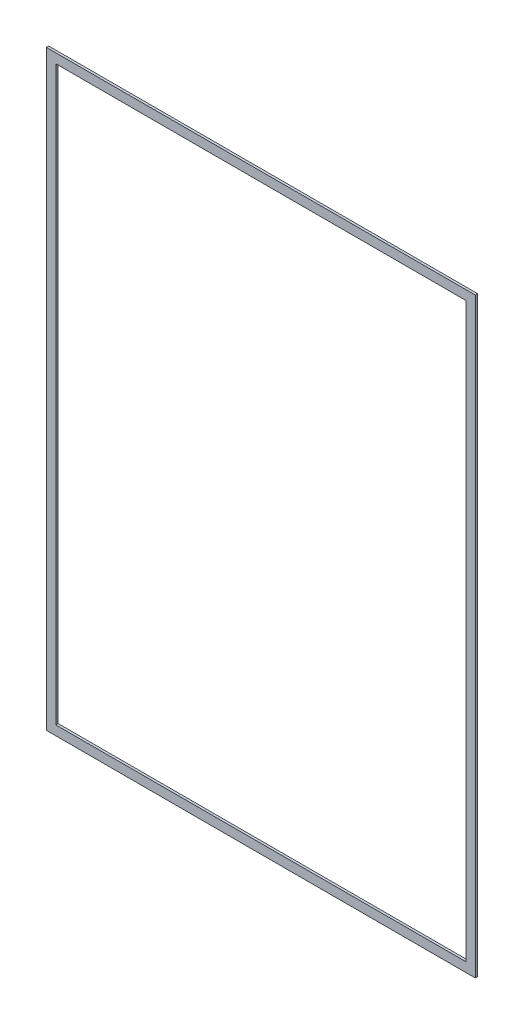
ISO-10303-21;
HEADER;
FILE_DESCRIPTION(('STEP AP214'),'2;1');
FILE_NAME('part.step','',(''),(''),'','','');
FILE_SCHEMA(('AUTOMOTIVE_DESIGN { 1 0 10303 214 1 1 1 1 }'));
ENDSEC;
DATA;
#1=APPLICATION_CONTEXT('core data for automotive mechanical design processes');
#2=APPLICATION_PROTOCOL_DEFINITION('international standard','automotive_design',2000,#1);
#3=PRODUCT_CONTEXT('',#1,'mechanical');
#4=PRODUCT('Part','Part','',(#3));
#5=PRODUCT_RELATED_PRODUCT_CATEGORY('part','',(#4));
#6=PRODUCT_DEFINITION_FORMATION('','',#4);
#7=PRODUCT_DEFINITION_CONTEXT('part definition',#1,'design');
#8=PRODUCT_DEFINITION('design','',#6,#7);
#9=PRODUCT_DEFINITION_SHAPE('','',#8);
#10=(LENGTH_UNIT() NAMED_UNIT(*) SI_UNIT(.MILLI.,.METRE.));
#11=(NAMED_UNIT(*) PLANE_ANGLE_UNIT() SI_UNIT($,.RADIAN.));
#12=(NAMED_UNIT(*) SI_UNIT($,.STERADIAN.) SOLID_ANGLE_UNIT());
#13=UNCERTAINTY_MEASURE_WITH_UNIT(LENGTH_MEASURE(1.E-05),#10,'distance_accuracy_value','');
#14=(GEOMETRIC_REPRESENTATION_CONTEXT(3) GLOBAL_UNCERTAINTY_ASSIGNED_CONTEXT((#13)) GLOBAL_UNIT_ASSIGNED_CONTEXT((#10,
#11,#12)) REPRESENTATION_CONTEXT('',''));
#15=CARTESIAN_POINT('',(0.,0.,0.));
#16=DIRECTION('',(0.,0.,1.));
#17=DIRECTION('',(1.,0.,0.));
#18=AXIS2_PLACEMENT_3D('',#15,#16,#17);
#19=CARTESIAN_POINT('',(0.,0.,3.175));
#20=DIRECTION('',(0.,0.,-1.));
#21=DIRECTION('',(-1.,0.,0.));
#22=AXIS2_PLACEMENT_3D('',#19,#20,#21);
#23=PLANE('',#22);
#24=DIRECTION('',(0.,1.,0.));
#25=VECTOR('',#24,1.);
#26=CARTESIAN_POINT('',(289.0266,-398.5133,3.175));
#27=LINE('',#26,#25);
#28=CARTESIAN_POINT('',(289.0266,-398.5133,3.175));
#29=VERTEX_POINT('',#28);
#30=CARTESIAN_POINT('',(289.0266,398.5133,3.175));
#31=VERTEX_POINT('',#30);
#32=EDGE_CURVE('E134',#29,#31,#27,.T.);
#33=ORIENTED_EDGE('',*,*,#32,.T.);
#34=DIRECTION('',(-1.,0.,0.));
#35=VECTOR('',#34,1.);
#36=CARTESIAN_POINT('',(-289.0266,398.5133,3.175));
#37=LINE('',#36,#35);
#38=CARTESIAN_POINT('',(-289.0266,398.5133,3.175));
#39=VERTEX_POINT('',#38);
#40=EDGE_CURVE('E137',#31,#39,#37,.T.);
#41=ORIENTED_EDGE('',*,*,#40,.T.);
#42=DIRECTION('',(0.,-1.,0.));
#43=VECTOR('',#42,1.);
#44=CARTESIAN_POINT('',(-289.0266,-398.5133,3.175));
#45=LINE('',#44,#43);
#46=CARTESIAN_POINT('',(-289.0266,-398.5133,3.175));
#47=VERTEX_POINT('',#46);
#48=EDGE_CURVE('E140',#39,#47,#45,.T.);
#49=ORIENTED_EDGE('',*,*,#48,.T.);
#50=DIRECTION('',(1.,0.,0.));
#51=VECTOR('',#50,1.);
#52=CARTESIAN_POINT('',(-289.0266,-398.5133,3.175));
#53=LINE('',#52,#51);
#54=EDGE_CURVE('E142',#47,#29,#53,.T.);
#55=ORIENTED_EDGE('',*,*,#54,.T.);
#56=EDGE_LOOP('',(#33,#41,#49,#55));
#57=FACE_BOUND('',#56,.T.);
#58=DIRECTION('',(0.,-1.,0.));
#59=VECTOR('',#58,1.);
#60=CARTESIAN_POINT('',(-276.3266,-385.8133,3.175));
#61=LINE('',#60,#59);
#62=CARTESIAN_POINT('',(-276.3266,385.8133,3.175));
#63=VERTEX_POINT('',#62);
#64=CARTESIAN_POINT('',(-276.3266,-385.8133,3.175));
#65=VERTEX_POINT('',#64);
#66=EDGE_CURVE('E98',#63,#65,#61,.T.);
#67=ORIENTED_EDGE('',*,*,#66,.F.);
#68=DIRECTION('',(-1.,0.,0.));
#69=VECTOR('',#68,1.);
#70=CARTESIAN_POINT('',(-276.3266,385.8133,3.175));
#71=LINE('',#70,#69);
#72=CARTESIAN_POINT('',(276.3266,385.8133,3.175));
#73=VERTEX_POINT('',#72);
#74=EDGE_CURVE('E120',#73,#63,#71,.T.);
#75=ORIENTED_EDGE('',*,*,#74,.F.);
#76=DIRECTION('',(0.,1.,0.));
#77=VECTOR('',#76,1.);
#78=CARTESIAN_POINT('',(276.3266,-385.8133,3.175));
#79=LINE('',#78,#77);
#80=CARTESIAN_POINT('',(276.3266,-385.8133,3.175));
#81=VERTEX_POINT('',#80);
#82=EDGE_CURVE('E118',#81,#73,#79,.T.);
#83=ORIENTED_EDGE('',*,*,#82,.F.);
#84=DIRECTION('',(1.,0.,0.));
#85=VECTOR('',#84,1.);
#86=CARTESIAN_POINT('',(-276.3266,-385.8133,3.175));
#87=LINE('',#86,#85);
#88=EDGE_CURVE('E106',#65,#81,#87,.T.);
#89=ORIENTED_EDGE('',*,*,#88,.F.);
#90=EDGE_LOOP('',(#67,#75,#83,#89));
#91=FACE_BOUND('',#90,.T.);
#92=ADVANCED_FACE('F33',(#57,#91),#23,.F.);
#93=CARTESIAN_POINT('',(0.,0.,0.));
#94=DIRECTION('',(0.,0.,-1.));
#95=DIRECTION('',(-1.,0.,0.));
#96=AXIS2_PLACEMENT_3D('',#93,#94,#95);
#97=PLANE('',#96);
#98=DIRECTION('',(0.,1.,0.));
#99=VECTOR('',#98,1.);
#100=CARTESIAN_POINT('',(289.0266,-398.5133,0.));
#101=LINE('',#100,#99);
#102=CARTESIAN_POINT('',(289.0266,-398.5133,0.));
#103=VERTEX_POINT('',#102);
#104=CARTESIAN_POINT('',(289.0266,398.5133,0.));
#105=VERTEX_POINT('',#104);
#106=EDGE_CURVE('E114',#103,#105,#101,.T.);
#107=ORIENTED_EDGE('',*,*,#106,.F.);
#108=DIRECTION('',(1.,0.,0.));
#109=VECTOR('',#108,1.);
#110=CARTESIAN_POINT('',(-289.0266,-398.5133,0.));
#111=LINE('',#110,#109);
#112=CARTESIAN_POINT('',(-289.0266,-398.5133,0.));
#113=VERTEX_POINT('',#112);
#114=EDGE_CURVE('E138',#113,#103,#111,.T.);
#115=ORIENTED_EDGE('',*,*,#114,.F.);
#116=DIRECTION('',(0.,-1.,0.));
#117=VECTOR('',#116,1.);
#118=CARTESIAN_POINT('',(-289.0266,-398.5133,0.));
#119=LINE('',#118,#117);
#120=CARTESIAN_POINT('',(-289.0266,398.5133,0.));
#121=VERTEX_POINT('',#120);
#122=EDGE_CURVE('E149',#121,#113,#119,.T.);
#123=ORIENTED_EDGE('',*,*,#122,.F.);
#124=DIRECTION('',(-1.,0.,0.));
#125=VECTOR('',#124,1.);
#126=CARTESIAN_POINT('',(-289.0266,398.5133,0.));
#127=LINE('',#126,#125);
#128=EDGE_CURVE('E147',#105,#121,#127,.T.);
#129=ORIENTED_EDGE('',*,*,#128,.F.);
#130=EDGE_LOOP('',(#107,#115,#123,#129));
#131=FACE_BOUND('',#130,.T.);
#132=DIRECTION('',(-1.,0.,0.));
#133=VECTOR('',#132,1.);
#134=CARTESIAN_POINT('',(-276.3266,385.8133,0.));
#135=LINE('',#134,#133);
#136=CARTESIAN_POINT('',(276.3266,385.8133,0.));
#137=VERTEX_POINT('',#136);
#138=CARTESIAN_POINT('',(-276.3266,385.8133,0.));
#139=VERTEX_POINT('',#138);
#140=EDGE_CURVE('E107',#137,#139,#135,.T.);
#141=ORIENTED_EDGE('',*,*,#140,.T.);
#142=DIRECTION('',(0.,-1.,0.));
#143=VECTOR('',#142,1.);
#144=CARTESIAN_POINT('',(-276.3266,-385.8133,0.));
#145=LINE('',#144,#143);
#146=CARTESIAN_POINT('',(-276.3266,-385.8133,0.));
#147=VERTEX_POINT('',#146);
#148=EDGE_CURVE('E56',#139,#147,#145,.T.);
#149=ORIENTED_EDGE('',*,*,#148,.T.);
#150=DIRECTION('',(1.,0.,0.));
#151=VECTOR('',#150,1.);
#152=CARTESIAN_POINT('',(-276.3266,-385.8133,0.));
#153=LINE('',#152,#151);
#154=CARTESIAN_POINT('',(276.3266,-385.8133,0.));
#155=VERTEX_POINT('',#154);
#156=EDGE_CURVE('E113',#147,#155,#153,.T.);
#157=ORIENTED_EDGE('',*,*,#156,.T.);
#158=DIRECTION('',(0.,1.,0.));
#159=VECTOR('',#158,1.);
#160=CARTESIAN_POINT('',(276.3266,-385.8133,0.));
#161=LINE('',#160,#159);
#162=EDGE_CURVE('E126',#155,#137,#161,.T.);
#163=ORIENTED_EDGE('',*,*,#162,.T.);
#164=EDGE_LOOP('',(#141,#149,#157,#163));
#165=FACE_BOUND('',#164,.T.);
#166=ADVANCED_FACE('F167',(#131,#165),#97,.T.);
#167=CARTESIAN_POINT('',(289.0266,-398.5133,3.175));
#168=DIRECTION('',(-1.,0.,0.));
#169=DIRECTION('',(0.,0.,1.));
#170=AXIS2_PLACEMENT_3D('',#167,#168,#169);
#171=PLANE('',#170);
#172=ORIENTED_EDGE('',*,*,#106,.T.);
#173=DIRECTION('',(0.,0.,-1.));
#174=VECTOR('',#173,1.);
#175=CARTESIAN_POINT('',(289.0266,398.5133,3.175));
#176=LINE('',#175,#174);
#177=EDGE_CURVE('E11',#31,#105,#176,.T.);
#178=ORIENTED_EDGE('',*,*,#177,.F.);
#179=ORIENTED_EDGE('',*,*,#32,.F.);
#180=DIRECTION('',(0.,0.,-1.));
#181=VECTOR('',#180,1.);
#182=CARTESIAN_POINT('',(289.0266,-398.5133,3.175));
#183=LINE('',#182,#181);
#184=EDGE_CURVE('E144',#29,#103,#183,.T.);
#185=ORIENTED_EDGE('',*,*,#184,.T.);
#186=EDGE_LOOP('',(#172,#178,#179,#185));
#187=FACE_BOUND('',#186,.T.);
#188=ADVANCED_FACE('F35',(#187),#171,.F.);
#189=CARTESIAN_POINT('',(-289.0266,398.5133,3.175));
#190=DIRECTION('',(0.,-1.,0.));
#191=DIRECTION('',(0.,0.,-1.));
#192=AXIS2_PLACEMENT_3D('',#189,#190,#191);
#193=PLANE('',#192);
#194=ORIENTED_EDGE('',*,*,#128,.T.);
#195=DIRECTION('',(0.,0.,-1.));
#196=VECTOR('',#195,1.);
#197=CARTESIAN_POINT('',(-289.0266,398.5133,3.175));
#198=LINE('',#197,#196);
#199=EDGE_CURVE('E41',#39,#121,#198,.T.);
#200=ORIENTED_EDGE('',*,*,#199,.F.);
#201=ORIENTED_EDGE('',*,*,#40,.F.);
#202=ORIENTED_EDGE('',*,*,#177,.T.);
#203=EDGE_LOOP('',(#194,#200,#201,#202));
#204=FACE_BOUND('',#203,.T.);
#205=ADVANCED_FACE('F177',(#204),#193,.F.);
#206=CARTESIAN_POINT('',(-289.0266,-398.5133,3.175));
#207=DIRECTION('',(1.,0.,0.));
#208=DIRECTION('',(0.,0.,-1.));
#209=AXIS2_PLACEMENT_3D('',#206,#207,#208);
#210=PLANE('',#209);
#211=ORIENTED_EDGE('',*,*,#122,.T.);
#212=DIRECTION('',(0.,0.,-1.));
#213=VECTOR('',#212,1.);
#214=CARTESIAN_POINT('',(-289.0266,-398.5133,3.175));
#215=LINE('',#214,#213);
#216=EDGE_CURVE('E154',#47,#113,#215,.T.);
#217=ORIENTED_EDGE('',*,*,#216,.F.);
#218=ORIENTED_EDGE('',*,*,#48,.F.);
#219=ORIENTED_EDGE('',*,*,#199,.T.);
#220=EDGE_LOOP('',(#211,#217,#218,#219));
#221=FACE_BOUND('',#220,.T.);
#222=ADVANCED_FACE('F161',(#221),#210,.F.);
#223=CARTESIAN_POINT('',(-289.0266,-398.5133,3.175));
#224=DIRECTION('',(0.,1.,0.));
#225=DIRECTION('',(0.,0.,1.));
#226=AXIS2_PLACEMENT_3D('',#223,#224,#225);
#227=PLANE('',#226);
#228=ORIENTED_EDGE('',*,*,#114,.T.);
#229=ORIENTED_EDGE('',*,*,#184,.F.);
#230=ORIENTED_EDGE('',*,*,#54,.F.);
#231=ORIENTED_EDGE('',*,*,#216,.T.);
#232=EDGE_LOOP('',(#228,#229,#230,#231));
#233=FACE_BOUND('',#232,.T.);
#234=ADVANCED_FACE('F171',(#233),#227,.F.);
#235=CARTESIAN_POINT('',(-276.3266,-385.8133,3.175));
#236=DIRECTION('',(1.,0.,0.));
#237=DIRECTION('',(0.,0.,-1.));
#238=AXIS2_PLACEMENT_3D('',#235,#236,#237);
#239=PLANE('',#238);
#240=ORIENTED_EDGE('',*,*,#148,.F.);
#241=DIRECTION('',(0.,0.,-1.));
#242=VECTOR('',#241,1.);
#243=CARTESIAN_POINT('',(-276.3266,385.8133,3.175));
#244=LINE('',#243,#242);
#245=EDGE_CURVE('E102',#63,#139,#244,.T.);
#246=ORIENTED_EDGE('',*,*,#245,.F.);
#247=ORIENTED_EDGE('',*,*,#66,.T.);
#248=DIRECTION('',(0.,0.,-1.));
#249=VECTOR('',#248,1.);
#250=CARTESIAN_POINT('',(-276.3266,-385.8133,3.175));
#251=LINE('',#250,#249);
#252=EDGE_CURVE('E101',#65,#147,#251,.T.);
#253=ORIENTED_EDGE('',*,*,#252,.T.);
#254=EDGE_LOOP('',(#240,#246,#247,#253));
#255=FACE_BOUND('',#254,.T.);
#256=ADVANCED_FACE('F100',(#255),#239,.T.);
#257=CARTESIAN_POINT('',(-276.3266,-385.8133,3.175));
#258=DIRECTION('',(0.,1.,0.));
#259=DIRECTION('',(0.,0.,1.));
#260=AXIS2_PLACEMENT_3D('',#257,#258,#259);
#261=PLANE('',#260);
#262=ORIENTED_EDGE('',*,*,#156,.F.);
#263=ORIENTED_EDGE('',*,*,#252,.F.);
#264=ORIENTED_EDGE('',*,*,#88,.T.);
#265=DIRECTION('',(0.,0.,-1.));
#266=VECTOR('',#265,1.);
#267=CARTESIAN_POINT('',(276.3266,-385.8133,3.175));
#268=LINE('',#267,#266);
#269=EDGE_CURVE('E115',#81,#155,#268,.T.);
#270=ORIENTED_EDGE('',*,*,#269,.T.);
#271=EDGE_LOOP('',(#262,#263,#264,#270));
#272=FACE_BOUND('',#271,.T.);
#273=ADVANCED_FACE('F110',(#272),#261,.T.);
#274=CARTESIAN_POINT('',(276.3266,-385.8133,3.175));
#275=DIRECTION('',(-1.,0.,0.));
#276=DIRECTION('',(0.,-1.,0.));
#277=AXIS2_PLACEMENT_3D('',#274,#275,#276);
#278=PLANE('',#277);
#279=ORIENTED_EDGE('',*,*,#162,.F.);
#280=ORIENTED_EDGE('',*,*,#269,.F.);
#281=ORIENTED_EDGE('',*,*,#82,.T.);
#282=DIRECTION('',(0.,0.,-1.));
#283=VECTOR('',#282,1.);
#284=CARTESIAN_POINT('',(276.3266,385.8133,3.175));
#285=LINE('',#284,#283);
#286=EDGE_CURVE('E48',#73,#137,#285,.T.);
#287=ORIENTED_EDGE('',*,*,#286,.T.);
#288=EDGE_LOOP('',(#279,#280,#281,#287));
#289=FACE_BOUND('',#288,.T.);
#290=ADVANCED_FACE('F200',(#289),#278,.T.);
#291=CARTESIAN_POINT('',(-276.3266,385.8133,3.175));
#292=DIRECTION('',(0.,-1.,0.));
#293=DIRECTION('',(1.,0.,0.));
#294=AXIS2_PLACEMENT_3D('',#291,#292,#293);
#295=PLANE('',#294);
#296=ORIENTED_EDGE('',*,*,#140,.F.);
#297=ORIENTED_EDGE('',*,*,#286,.F.);
#298=ORIENTED_EDGE('',*,*,#74,.T.);
#299=ORIENTED_EDGE('',*,*,#245,.T.);
#300=EDGE_LOOP('',(#296,#297,#298,#299));
#301=FACE_BOUND('',#300,.T.);
#302=ADVANCED_FACE('F204',(#301),#295,.T.);
#303=CLOSED_SHELL('',(#92,#166,#188,#205,#222,#234,#256,#273,#290,#302));
#304=MANIFOLD_SOLID_BREP('B2',#303);
#305=ADVANCED_BREP_SHAPE_REPRESENTATION('',(#18,#304),#14);
#306=SHAPE_DEFINITION_REPRESENTATION(#9,#305);
ENDSEC;
END-ISO-10303-21;
